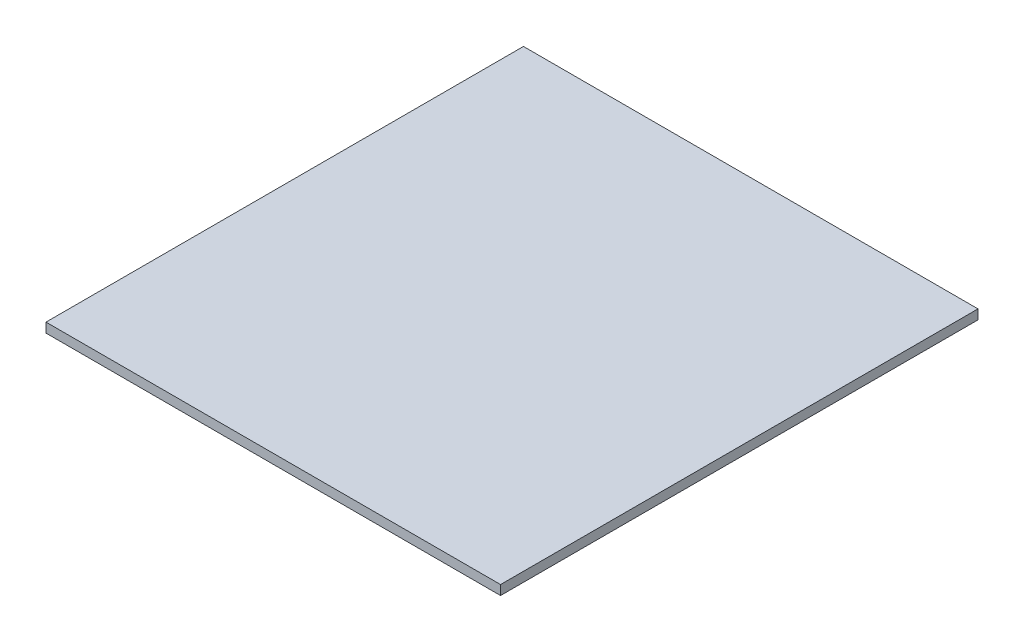
ISO-10303-21;
HEADER;
FILE_DESCRIPTION(('STEP AP214'),'2;1');
FILE_NAME('part.step','',(''),(''),'','','');
FILE_SCHEMA(('AUTOMOTIVE_DESIGN { 1 0 10303 214 1 1 1 1 }'));
ENDSEC;
DATA;
#1=APPLICATION_CONTEXT('core data for automotive mechanical design processes');
#2=APPLICATION_PROTOCOL_DEFINITION('international standard','automotive_design',2000,#1);
#3=PRODUCT_CONTEXT('',#1,'mechanical');
#4=PRODUCT('Part','Part','',(#3));
#5=PRODUCT_RELATED_PRODUCT_CATEGORY('part','',(#4));
#6=PRODUCT_DEFINITION_FORMATION('','',#4);
#7=PRODUCT_DEFINITION_CONTEXT('part definition',#1,'design');
#8=PRODUCT_DEFINITION('design','',#6,#7);
#9=PRODUCT_DEFINITION_SHAPE('','',#8);
#10=(LENGTH_UNIT() NAMED_UNIT(*) SI_UNIT(.MILLI.,.METRE.));
#11=(NAMED_UNIT(*) PLANE_ANGLE_UNIT() SI_UNIT($,.RADIAN.));
#12=(NAMED_UNIT(*) SI_UNIT($,.STERADIAN.) SOLID_ANGLE_UNIT());
#13=UNCERTAINTY_MEASURE_WITH_UNIT(LENGTH_MEASURE(1.E-05),#10,'distance_accuracy_value','');
#14=(GEOMETRIC_REPRESENTATION_CONTEXT(3) GLOBAL_UNCERTAINTY_ASSIGNED_CONTEXT((#13)) GLOBAL_UNIT_ASSIGNED_CONTEXT((#10,
#11,#12)) REPRESENTATION_CONTEXT('',''));
#15=CARTESIAN_POINT('',(0.,0.,0.));
#16=DIRECTION('',(0.,0.,1.));
#17=DIRECTION('',(1.,0.,0.));
#18=AXIS2_PLACEMENT_3D('',#15,#16,#17);
#19=CARTESIAN_POINT('',(0.,5.,0.));
#20=DIRECTION('',(1.,0.,0.));
#21=DIRECTION('',(0.,0.,-1.));
#22=AXIS2_PLACEMENT_3D('',#19,#20,#21);
#23=PLANE('',#22);
#24=DIRECTION('',(0.,0.,1.));
#25=VECTOR('',#24,1.);
#26=CARTESIAN_POINT('',(0.,0.,0.));
#27=LINE('',#26,#25);
#28=CARTESIAN_POINT('',(0.,0.,-250.));
#29=VERTEX_POINT('',#28);
#30=CARTESIAN_POINT('',(0.,0.,0.));
#31=VERTEX_POINT('',#30);
#32=EDGE_CURVE('E119',#29,#31,#27,.T.);
#33=ORIENTED_EDGE('',*,*,#32,.T.);
#34=DIRECTION('',(0.,-1.,0.));
#35=VECTOR('',#34,1.);
#36=CARTESIAN_POINT('',(0.,5.,0.));
#37=LINE('',#36,#35);
#38=CARTESIAN_POINT('',(0.,5.,0.));
#39=VERTEX_POINT('',#38);
#40=EDGE_CURVE('E11',#39,#31,#37,.T.);
#41=ORIENTED_EDGE('',*,*,#40,.F.);
#42=DIRECTION('',(0.,0.,1.));
#43=VECTOR('',#42,1.);
#44=CARTESIAN_POINT('',(0.,5.,0.));
#45=LINE('',#44,#43);
#46=CARTESIAN_POINT('',(0.,5.,-250.));
#47=VERTEX_POINT('',#46);
#48=EDGE_CURVE('E101',#47,#39,#45,.T.);
#49=ORIENTED_EDGE('',*,*,#48,.F.);
#50=DIRECTION('',(0.,-1.,0.));
#51=VECTOR('',#50,1.);
#52=CARTESIAN_POINT('',(0.,5.,-250.));
#53=LINE('',#52,#51);
#54=EDGE_CURVE('E115',#47,#29,#53,.T.);
#55=ORIENTED_EDGE('',*,*,#54,.T.);
#56=EDGE_LOOP('',(#33,#41,#49,#55));
#57=FACE_BOUND('',#56,.T.);
#58=ADVANCED_FACE('F41',(#57),#23,.F.);
#59=CARTESIAN_POINT('',(0.,5.,0.));
#60=DIRECTION('',(0.,0.,-1.));
#61=DIRECTION('',(-1.,0.,0.));
#62=AXIS2_PLACEMENT_3D('',#59,#60,#61);
#63=PLANE('',#62);
#64=DIRECTION('',(1.,0.,0.));
#65=VECTOR('',#64,1.);
#66=CARTESIAN_POINT('',(0.,0.,0.));
#67=LINE('',#66,#65);
#68=CARTESIAN_POINT('',(238.,0.,0.));
#69=VERTEX_POINT('',#68);
#70=EDGE_CURVE('E106',#31,#69,#67,.T.);
#71=ORIENTED_EDGE('',*,*,#70,.T.);
#72=DIRECTION('',(0.,-1.,0.));
#73=VECTOR('',#72,1.);
#74=CARTESIAN_POINT('',(238.,5.,0.));
#75=LINE('',#74,#73);
#76=CARTESIAN_POINT('',(238.,5.,0.));
#77=VERTEX_POINT('',#76);
#78=EDGE_CURVE('E50',#77,#69,#75,.T.);
#79=ORIENTED_EDGE('',*,*,#78,.F.);
#80=DIRECTION('',(1.,0.,0.));
#81=VECTOR('',#80,1.);
#82=CARTESIAN_POINT('',(0.,5.,0.));
#83=LINE('',#82,#81);
#84=EDGE_CURVE('E96',#39,#77,#83,.T.);
#85=ORIENTED_EDGE('',*,*,#84,.F.);
#86=ORIENTED_EDGE('',*,*,#40,.T.);
#87=EDGE_LOOP('',(#71,#79,#85,#86));
#88=FACE_BOUND('',#87,.T.);
#89=ADVANCED_FACE('F105',(#88),#63,.F.);
#90=CARTESIAN_POINT('',(238.,5.,0.));
#91=DIRECTION('',(-1.,0.,0.));
#92=DIRECTION('',(0.,0.,1.));
#93=AXIS2_PLACEMENT_3D('',#90,#91,#92);
#94=PLANE('',#93);
#95=DIRECTION('',(0.,0.,-1.));
#96=VECTOR('',#95,1.);
#97=CARTESIAN_POINT('',(238.,0.,0.));
#98=LINE('',#97,#96);
#99=CARTESIAN_POINT('',(238.,0.,-250.));
#100=VERTEX_POINT('',#99);
#101=EDGE_CURVE('E81',#69,#100,#98,.T.);
#102=ORIENTED_EDGE('',*,*,#101,.T.);
#103=DIRECTION('',(0.,-1.,0.));
#104=VECTOR('',#103,1.);
#105=CARTESIAN_POINT('',(238.,5.,-250.));
#106=LINE('',#105,#104);
#107=CARTESIAN_POINT('',(238.,5.,-250.));
#108=VERTEX_POINT('',#107);
#109=EDGE_CURVE('E108',#108,#100,#106,.T.);
#110=ORIENTED_EDGE('',*,*,#109,.F.);
#111=DIRECTION('',(0.,0.,-1.));
#112=VECTOR('',#111,1.);
#113=CARTESIAN_POINT('',(238.,5.,0.));
#114=LINE('',#113,#112);
#115=EDGE_CURVE('E99',#77,#108,#114,.T.);
#116=ORIENTED_EDGE('',*,*,#115,.F.);
#117=ORIENTED_EDGE('',*,*,#78,.T.);
#118=EDGE_LOOP('',(#102,#110,#116,#117));
#119=FACE_BOUND('',#118,.T.);
#120=ADVANCED_FACE('F109',(#119),#94,.F.);
#121=CARTESIAN_POINT('',(0.,5.,-250.));
#122=DIRECTION('',(0.,0.,1.));
#123=DIRECTION('',(1.,0.,0.));
#124=AXIS2_PLACEMENT_3D('',#121,#122,#123);
#125=PLANE('',#124);
#126=DIRECTION('',(-1.,0.,0.));
#127=VECTOR('',#126,1.);
#128=CARTESIAN_POINT('',(0.,0.,-250.));
#129=LINE('',#128,#127);
#130=EDGE_CURVE('E88',#100,#29,#129,.T.);
#131=ORIENTED_EDGE('',*,*,#130,.T.);
#132=ORIENTED_EDGE('',*,*,#54,.F.);
#133=DIRECTION('',(-1.,0.,0.));
#134=VECTOR('',#133,1.);
#135=CARTESIAN_POINT('',(0.,5.,-250.));
#136=LINE('',#135,#134);
#137=EDGE_CURVE('E60',#108,#47,#136,.T.);
#138=ORIENTED_EDGE('',*,*,#137,.F.);
#139=ORIENTED_EDGE('',*,*,#109,.T.);
#140=EDGE_LOOP('',(#131,#132,#138,#139));
#141=FACE_BOUND('',#140,.T.);
#142=ADVANCED_FACE('F130',(#141),#125,.F.);
#143=CARTESIAN_POINT('',(0.,5.,0.));
#144=DIRECTION('',(0.,-1.,0.));
#145=DIRECTION('',(0.,0.,-1.));
#146=AXIS2_PLACEMENT_3D('',#143,#144,#145);
#147=PLANE('',#146);
#148=ORIENTED_EDGE('',*,*,#48,.T.);
#149=ORIENTED_EDGE('',*,*,#84,.T.);
#150=ORIENTED_EDGE('',*,*,#115,.T.);
#151=ORIENTED_EDGE('',*,*,#137,.T.);
#152=EDGE_LOOP('',(#148,#149,#150,#151));
#153=FACE_BOUND('',#152,.T.);
#154=ADVANCED_FACE('F97',(#153),#147,.F.);
#155=CARTESIAN_POINT('',(0.,0.,0.));
#156=DIRECTION('',(0.,-1.,0.));
#157=DIRECTION('',(0.,0.,-1.));
#158=AXIS2_PLACEMENT_3D('',#155,#156,#157);
#159=PLANE('',#158);
#160=ORIENTED_EDGE('',*,*,#32,.F.);
#161=ORIENTED_EDGE('',*,*,#130,.F.);
#162=ORIENTED_EDGE('',*,*,#101,.F.);
#163=ORIENTED_EDGE('',*,*,#70,.F.);
#164=EDGE_LOOP('',(#160,#161,#162,#163));
#165=FACE_BOUND('',#164,.T.);
#166=ADVANCED_FACE('F133',(#165),#159,.T.);
#167=CLOSED_SHELL('',(#58,#89,#120,#142,#154,#166));
#168=MANIFOLD_SOLID_BREP('B2',#167);
#169=ADVANCED_BREP_SHAPE_REPRESENTATION('',(#18,#168),#14);
#170=SHAPE_DEFINITION_REPRESENTATION(#9,#169);
ENDSEC;
END-ISO-10303-21;
